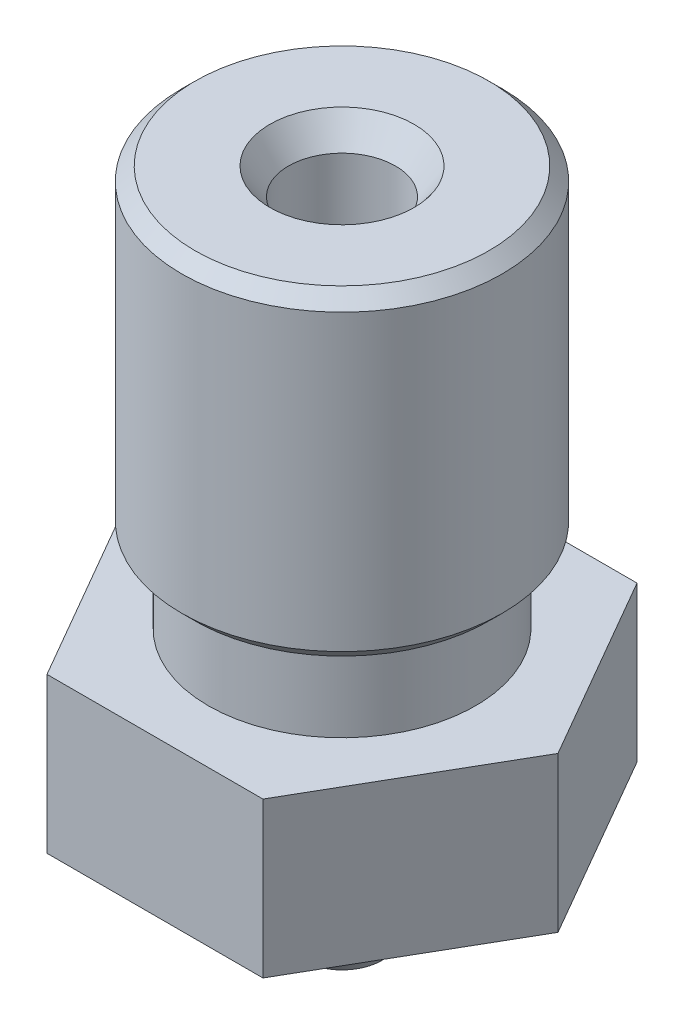
ISO-10303-21;
HEADER;
FILE_DESCRIPTION(('STEP AP214'),'2;1');
FILE_NAME('part.step','',(''),(''),'','','');
FILE_SCHEMA(('AUTOMOTIVE_DESIGN { 1 0 10303 214 1 1 1 1 }'));
ENDSEC;
DATA;
#1=APPLICATION_CONTEXT('core data for automotive mechanical design processes');
#2=APPLICATION_PROTOCOL_DEFINITION('international standard','automotive_design',2000,#1);
#3=PRODUCT_CONTEXT('',#1,'mechanical');
#4=PRODUCT('Part','Part','',(#3));
#5=PRODUCT_RELATED_PRODUCT_CATEGORY('part','',(#4));
#6=PRODUCT_DEFINITION_FORMATION('','',#4);
#7=PRODUCT_DEFINITION_CONTEXT('part definition',#1,'design');
#8=PRODUCT_DEFINITION('design','',#6,#7);
#9=PRODUCT_DEFINITION_SHAPE('','',#8);
#10=(LENGTH_UNIT() NAMED_UNIT(*) SI_UNIT(.MILLI.,.METRE.));
#11=(NAMED_UNIT(*) PLANE_ANGLE_UNIT() SI_UNIT($,.RADIAN.));
#12=(NAMED_UNIT(*) SI_UNIT($,.STERADIAN.) SOLID_ANGLE_UNIT());
#13=UNCERTAINTY_MEASURE_WITH_UNIT(LENGTH_MEASURE(1.E-05),#10,'distance_accuracy_value','');
#14=(GEOMETRIC_REPRESENTATION_CONTEXT(3) GLOBAL_UNCERTAINTY_ASSIGNED_CONTEXT((#13)) GLOBAL_UNIT_ASSIGNED_CONTEXT((#10,
#11,#12)) REPRESENTATION_CONTEXT('',''));
#15=CARTESIAN_POINT('',(0.,0.,0.));
#16=DIRECTION('',(0.,0.,1.));
#17=DIRECTION('',(1.,0.,0.));
#18=AXIS2_PLACEMENT_3D('',#15,#16,#17);
#19=CARTESIAN_POINT('',(0.75,-6.25,0.));
#20=DIRECTION('',(0.,-1.,0.));
#21=DIRECTION('',(0.,0.,-1.));
#22=AXIS2_PLACEMENT_3D('',#19,#20,#21);
#23=PLANE('',#22);
#24=CARTESIAN_POINT('',(0.,-6.25,0.));
#25=DIRECTION('',(0.,-1.,0.));
#26=DIRECTION('',(0.,0.,-1.));
#27=AXIS2_PLACEMENT_3D('',#24,#25,#26);
#28=CIRCLE('',#27,0.75);
#29=CARTESIAN_POINT('',(0.,-6.25,-0.75));
#30=VERTEX_POINT('',#29);
#31=EDGE_CURVE('E123',#30,#30,#28,.T.);
#32=ORIENTED_EDGE('',*,*,#31,.T.);
#33=EDGE_LOOP('',(#32));
#34=FACE_BOUND('',#33,.T.);
#35=CARTESIAN_POINT('',(0.,-6.25,0.));
#36=DIRECTION('',(0.,-1.,0.));
#37=DIRECTION('',(0.,0.,-1.));
#38=AXIS2_PLACEMENT_3D('',#35,#36,#37);
#39=CIRCLE('',#38,0.3);
#40=CARTESIAN_POINT('',(0.,-6.25,-0.3));
#41=VERTEX_POINT('',#40);
#42=EDGE_CURVE('E154',#41,#41,#39,.T.);
#43=ORIENTED_EDGE('',*,*,#42,.F.);
#44=EDGE_LOOP('',(#43));
#45=FACE_BOUND('',#44,.T.);
#46=ADVANCED_FACE('F32',(#34,#45),#23,.T.);
#47=CARTESIAN_POINT('',(0.,-6.25,0.));
#48=DIRECTION('',(0.,-1.,0.));
#49=DIRECTION('',(0.,0.,-1.));
#50=AXIS2_PLACEMENT_3D('',#47,#48,#49);
#51=CYLINDRICAL_SURFACE('',#50,0.3);
#52=ORIENTED_EDGE('',*,*,#42,.T.);
#53=EDGE_LOOP('',(#52));
#54=FACE_BOUND('',#53,.T.);
#55=CARTESIAN_POINT('',(0.,-5.05,0.));
#56=DIRECTION('',(0.,-1.,0.));
#57=DIRECTION('',(0.,0.,-1.));
#58=AXIS2_PLACEMENT_3D('',#55,#56,#57);
#59=CIRCLE('',#58,0.3);
#60=CARTESIAN_POINT('',(0.,-5.05,-0.3));
#61=VERTEX_POINT('',#60);
#62=EDGE_CURVE('E151',#61,#61,#59,.T.);
#63=ORIENTED_EDGE('',*,*,#62,.F.);
#64=EDGE_LOOP('',(#63));
#65=FACE_BOUND('',#64,.T.);
#66=ADVANCED_FACE('F196',(#54,#65),#51,.F.);
#67=CARTESIAN_POINT('',(0.,-4.74056606371057,0.));
#68=DIRECTION('',(0.,1.,0.));
#69=DIRECTION('',(0.,0.,1.));
#70=AXIS2_PLACEMENT_3D('',#67,#68,#69);
#71=CONICAL_SURFACE('',#70,0.995,1.15191730631626);
#72=ORIENTED_EDGE('',*,*,#62,.T.);
#73=EDGE_LOOP('',(#72));
#74=FACE_BOUND('',#73,.T.);
#75=CARTESIAN_POINT('',(0.,-4.74056606371057,0.));
#76=DIRECTION('',(0.,-1.,0.));
#77=DIRECTION('',(0.,0.,-1.));
#78=AXIS2_PLACEMENT_3D('',#75,#76,#77);
#79=CIRCLE('',#78,0.995);
#80=CARTESIAN_POINT('',(0.,-4.74056606371057,-0.995));
#81=VERTEX_POINT('',#80);
#82=EDGE_CURVE('E148',#81,#81,#79,.T.);
#83=ORIENTED_EDGE('',*,*,#82,.F.);
#84=EDGE_LOOP('',(#83));
#85=FACE_BOUND('',#84,.T.);
#86=ADVANCED_FACE('F202',(#74,#85),#71,.F.);
#87=CARTESIAN_POINT('',(0.,-6.25,0.));
#88=DIRECTION('',(0.,-1.,0.));
#89=DIRECTION('',(0.,0.,-1.));
#90=AXIS2_PLACEMENT_3D('',#87,#88,#89);
#91=CYLINDRICAL_SURFACE('',#90,0.995);
#92=ORIENTED_EDGE('',*,*,#82,.T.);
#93=EDGE_LOOP('',(#92));
#94=FACE_BOUND('',#93,.T.);
#95=CARTESIAN_POINT('',(0.,-4.1522261434488,0.));
#96=DIRECTION('',(0.,-1.,0.));
#97=DIRECTION('',(0.,0.,-1.));
#98=AXIS2_PLACEMENT_3D('',#95,#96,#97);
#99=CIRCLE('',#98,0.995);
#100=CARTESIAN_POINT('',(0.,-4.1522261434488,-0.995));
#101=VERTEX_POINT('',#100);
#102=EDGE_CURVE('E145',#101,#101,#99,.T.);
#103=ORIENTED_EDGE('',*,*,#102,.F.);
#104=EDGE_LOOP('',(#103));
#105=FACE_BOUND('',#104,.T.);
#106=ADVANCED_FACE('F209',(#94,#105),#91,.F.);
#107=CARTESIAN_POINT('',(0.,-4.15,0.));
#108=DIRECTION('',(0.,1.,0.));
#109=DIRECTION('',(0.,0.,1.));
#110=AXIS2_PLACEMENT_3D('',#107,#108,#109);
#111=CONICAL_SURFACE('',#110,1.00000000005,1.15191730631624);
#112=ORIENTED_EDGE('',*,*,#102,.T.);
#113=EDGE_LOOP('',(#112));
#114=FACE_BOUND('',#113,.T.);
#115=CARTESIAN_POINT('',(0.,-4.15,0.));
#116=DIRECTION('',(0.,-1.,0.));
#117=DIRECTION('',(0.,0.,-1.));
#118=AXIS2_PLACEMENT_3D('',#115,#116,#117);
#119=CIRCLE('',#118,1.00000000005);
#120=CARTESIAN_POINT('',(0.,-4.15,-1.00000000005));
#121=VERTEX_POINT('',#120);
#122=EDGE_CURVE('E142',#121,#121,#119,.T.);
#123=ORIENTED_EDGE('',*,*,#122,.F.);
#124=EDGE_LOOP('',(#123));
#125=FACE_BOUND('',#124,.T.);
#126=ADVANCED_FACE('F213',(#114,#125),#111,.F.);
#127=CARTESIAN_POINT('',(0.,-6.25,0.));
#128=DIRECTION('',(0.,-1.,0.));
#129=DIRECTION('',(0.,0.,-1.));
#130=AXIS2_PLACEMENT_3D('',#127,#128,#129);
#131=CYLINDRICAL_SURFACE('',#130,1.00000000005);
#132=ORIENTED_EDGE('',*,*,#122,.T.);
#133=EDGE_LOOP('',(#132));
#134=FACE_BOUND('',#133,.T.);
#135=CARTESIAN_POINT('',(0.,5.75,0.));
#136=DIRECTION('',(0.,-1.,0.));
#137=DIRECTION('',(0.,0.,-1.));
#138=AXIS2_PLACEMENT_3D('',#135,#136,#137);
#139=CIRCLE('',#138,1.00000000005);
#140=CARTESIAN_POINT('',(0.,5.75,-1.00000000005));
#141=VERTEX_POINT('',#140);
#142=EDGE_CURVE('E139',#141,#141,#139,.T.);
#143=ORIENTED_EDGE('',*,*,#142,.F.);
#144=EDGE_LOOP('',(#143));
#145=FACE_BOUND('',#144,.T.);
#146=ADVANCED_FACE('F217',(#134,#145),#131,.F.);
#147=CARTESIAN_POINT('',(0.,6.25,0.));
#148=DIRECTION('',(0.,1.,0.));
#149=DIRECTION('',(0.,0.,1.));
#150=AXIS2_PLACEMENT_3D('',#147,#148,#149);
#151=CONICAL_SURFACE('',#150,1.35010376915485,0.610865238198013);
#152=ORIENTED_EDGE('',*,*,#142,.T.);
#153=EDGE_LOOP('',(#152));
#154=FACE_BOUND('',#153,.T.);
#155=CARTESIAN_POINT('',(0.,6.25,0.));
#156=DIRECTION('',(0.,-1.,0.));
#157=DIRECTION('',(0.,0.,-1.));
#158=AXIS2_PLACEMENT_3D('',#155,#156,#157);
#159=CIRCLE('',#158,1.35010376915485);
#160=CARTESIAN_POINT('',(0.,6.25,-1.35010376915485));
#161=VERTEX_POINT('',#160);
#162=EDGE_CURVE('E136',#161,#161,#159,.T.);
#163=ORIENTED_EDGE('',*,*,#162,.F.);
#164=EDGE_LOOP('',(#163));
#165=FACE_BOUND('',#164,.T.);
#166=ADVANCED_FACE('F221',(#154,#165),#151,.F.);
#167=CARTESIAN_POINT('',(1.35010376915485,6.25,0.));
#168=DIRECTION('',(0.,1.,0.));
#169=DIRECTION('',(0.,0.,1.));
#170=AXIS2_PLACEMENT_3D('',#167,#168,#169);
#171=PLANE('',#170);
#172=CARTESIAN_POINT('',(0.,6.25,0.));
#173=DIRECTION('',(0.,1.,0.));
#174=DIRECTION('',(0.,0.,1.));
#175=AXIS2_PLACEMENT_3D('',#172,#173,#174);
#176=CIRCLE('',#175,2.75);
#177=CARTESIAN_POINT('',(0.,6.25,2.75));
#178=VERTEX_POINT('',#177);
#179=EDGE_CURVE('E11',#178,#178,#176,.T.);
#180=ORIENTED_EDGE('',*,*,#179,.T.);
#181=EDGE_LOOP('',(#180));
#182=FACE_BOUND('',#181,.T.);
#183=ORIENTED_EDGE('',*,*,#162,.T.);
#184=EDGE_LOOP('',(#183));
#185=FACE_BOUND('',#184,.T.);
#186=ADVANCED_FACE('F225',(#182,#185),#171,.T.);
#187=CARTESIAN_POINT('',(0.,-6.25,0.));
#188=DIRECTION('',(0.,-1.,0.));
#189=DIRECTION('',(0.,0.,-1.));
#190=AXIS2_PLACEMENT_3D('',#187,#188,#189);
#191=CYLINDRICAL_SURFACE('',#190,3.);
#192=CARTESIAN_POINT('',(0.,0.5,0.));
#193=DIRECTION('',(0.,-1.,0.));
#194=DIRECTION('',(0.,0.,-1.));
#195=AXIS2_PLACEMENT_3D('',#192,#193,#194);
#196=CIRCLE('',#195,3.);
#197=CARTESIAN_POINT('',(0.,0.5,-3.));
#198=VERTEX_POINT('',#197);
#199=EDGE_CURVE('E40',#198,#198,#196,.F.);
#200=ORIENTED_EDGE('',*,*,#199,.T.);
#201=EDGE_LOOP('',(#200));
#202=FACE_BOUND('',#201,.T.);
#203=CARTESIAN_POINT('',(0.,6.,0.));
#204=DIRECTION('',(0.,1.,0.));
#205=DIRECTION('',(0.,0.,1.));
#206=AXIS2_PLACEMENT_3D('',#203,#204,#205);
#207=CIRCLE('',#206,3.);
#208=CARTESIAN_POINT('',(0.,6.,3.));
#209=VERTEX_POINT('',#208);
#210=EDGE_CURVE('E160',#209,#209,#207,.F.);
#211=ORIENTED_EDGE('',*,*,#210,.T.);
#212=EDGE_LOOP('',(#211));
#213=FACE_BOUND('',#212,.T.);
#214=ADVANCED_FACE('F165',(#202,#213),#191,.T.);
#215=CARTESIAN_POINT('',(2.5,0.25,0.));
#216=DIRECTION('',(0.,-1.,0.));
#217=DIRECTION('',(0.,0.,-1.));
#218=AXIS2_PLACEMENT_3D('',#215,#216,#217);
#219=PLANE('',#218);
#220=CARTESIAN_POINT('',(0.,0.25,0.));
#221=DIRECTION('',(0.,-1.,0.));
#222=DIRECTION('',(0.,0.,-1.));
#223=AXIS2_PLACEMENT_3D('',#220,#221,#222);
#224=CIRCLE('',#223,2.75);
#225=CARTESIAN_POINT('',(0.,0.25,-2.75));
#226=VERTEX_POINT('',#225);
#227=EDGE_CURVE('E157',#226,#226,#224,.T.);
#228=ORIENTED_EDGE('',*,*,#227,.T.);
#229=EDGE_LOOP('',(#228));
#230=FACE_BOUND('',#229,.T.);
#231=CARTESIAN_POINT('',(0.,0.25,0.));
#232=DIRECTION('',(0.,-1.,0.));
#233=DIRECTION('',(0.,0.,-1.));
#234=AXIS2_PLACEMENT_3D('',#231,#232,#233);
#235=CIRCLE('',#234,2.5);
#236=CARTESIAN_POINT('',(0.,0.25,-2.5));
#237=VERTEX_POINT('',#236);
#238=EDGE_CURVE('E133',#237,#237,#235,.T.);
#239=ORIENTED_EDGE('',*,*,#238,.F.);
#240=EDGE_LOOP('',(#239));
#241=FACE_BOUND('',#240,.T.);
#242=ADVANCED_FACE('F174',(#230,#241),#219,.T.);
#243=CARTESIAN_POINT('',(0.,-6.25,0.));
#244=DIRECTION('',(0.,-1.,0.));
#245=DIRECTION('',(0.,0.,-1.));
#246=AXIS2_PLACEMENT_3D('',#243,#244,#245);
#247=CYLINDRICAL_SURFACE('',#246,2.5);
#248=ORIENTED_EDGE('',*,*,#238,.T.);
#249=EDGE_LOOP('',(#248));
#250=FACE_BOUND('',#249,.T.);
#251=CARTESIAN_POINT('',(0.,-1.25,0.));
#252=DIRECTION('',(0.,-1.,0.));
#253=DIRECTION('',(0.,0.,-1.));
#254=AXIS2_PLACEMENT_3D('',#251,#252,#253);
#255=CIRCLE('',#254,2.5);
#256=CARTESIAN_POINT('',(0.,-1.25,-2.5));
#257=VERTEX_POINT('',#256);
#258=EDGE_CURVE('E130',#257,#257,#255,.T.);
#259=ORIENTED_EDGE('',*,*,#258,.F.);
#260=EDGE_LOOP('',(#259));
#261=FACE_BOUND('',#260,.T.);
#262=ADVANCED_FACE('F177',(#250,#261),#247,.T.);
#263=CARTESIAN_POINT('',(2.5,-1.25,0.));
#264=DIRECTION('',(0.,1.,0.));
#265=DIRECTION('',(0.,0.,1.));
#266=AXIS2_PLACEMENT_3D('',#263,#264,#265);
#267=PLANE('',#266);
#268=ORIENTED_EDGE('',*,*,#258,.T.);
#269=EDGE_LOOP('',(#268));
#270=FACE_BOUND('',#269,.T.);
#271=DIRECTION('',(-0.5,0.,0.866025403784439));
#272=VECTOR('',#271,1.);
#273=CARTESIAN_POINT('',(4.04145188432738,-1.25,0.));
#274=LINE('',#273,#272);
#275=CARTESIAN_POINT('',(4.04145188432738,-1.25,0.));
#276=VERTEX_POINT('',#275);
#277=CARTESIAN_POINT('',(2.02072594216369,-1.25,3.5));
#278=VERTEX_POINT('',#277);
#279=EDGE_CURVE('E47',#276,#278,#274,.T.);
#280=ORIENTED_EDGE('',*,*,#279,.F.);
#281=DIRECTION('',(0.5,0.,0.866025403784439));
#282=VECTOR('',#281,1.);
#283=CARTESIAN_POINT('',(2.02072594216369,-1.25,-3.5));
#284=LINE('',#283,#282);
#285=CARTESIAN_POINT('',(2.02072594216369,-1.25,-3.5));
#286=VERTEX_POINT('',#285);
#287=EDGE_CURVE('E103',#286,#276,#284,.T.);
#288=ORIENTED_EDGE('',*,*,#287,.F.);
#289=DIRECTION('',(1.,0.,0.));
#290=VECTOR('',#289,1.);
#291=CARTESIAN_POINT('',(-2.02072594216369,-1.25,-3.5));
#292=LINE('',#291,#290);
#293=CARTESIAN_POINT('',(-2.02072594216369,-1.25,-3.5));
#294=VERTEX_POINT('',#293);
#295=EDGE_CURVE('E101',#294,#286,#292,.T.);
#296=ORIENTED_EDGE('',*,*,#295,.F.);
#297=DIRECTION('',(0.5,0.,-0.866025403784439));
#298=VECTOR('',#297,1.);
#299=CARTESIAN_POINT('',(-4.04145188432738,-1.25,0.));
#300=LINE('',#299,#298);
#301=CARTESIAN_POINT('',(-4.04145188432738,-1.25,0.));
#302=VERTEX_POINT('',#301);
#303=EDGE_CURVE('E89',#302,#294,#300,.T.);
#304=ORIENTED_EDGE('',*,*,#303,.F.);
#305=DIRECTION('',(-0.5,0.,-0.866025403784439));
#306=VECTOR('',#305,1.);
#307=CARTESIAN_POINT('',(-2.02072594216369,-1.25,3.5));
#308=LINE('',#307,#306);
#309=CARTESIAN_POINT('',(-2.02072594216369,-1.25,3.5));
#310=VERTEX_POINT('',#309);
#311=EDGE_CURVE('E111',#310,#302,#308,.T.);
#312=ORIENTED_EDGE('',*,*,#311,.F.);
#313=DIRECTION('',(-1.,0.,0.));
#314=VECTOR('',#313,1.);
#315=CARTESIAN_POINT('',(2.02072594216369,-1.25,3.5));
#316=LINE('',#315,#314);
#317=EDGE_CURVE('E55',#278,#310,#316,.T.);
#318=ORIENTED_EDGE('',*,*,#317,.F.);
#319=EDGE_LOOP('',(#280,#288,#296,#304,#312,#318));
#320=FACE_BOUND('',#319,.T.);
#321=ADVANCED_FACE('F102',(#270,#320),#267,.T.);
#322=CARTESIAN_POINT('',(3.5,-4.15,0.));
#323=DIRECTION('',(0.,-1.,0.));
#324=DIRECTION('',(0.,0.,-1.));
#325=AXIS2_PLACEMENT_3D('',#322,#323,#324);
#326=PLANE('',#325);
#327=DIRECTION('',(-0.5,0.,-0.866025403784439));
#328=VECTOR('',#327,1.);
#329=CARTESIAN_POINT('',(-2.02072594216369,-4.15,3.5));
#330=LINE('',#329,#328);
#331=CARTESIAN_POINT('',(-2.02072594216369,-4.15,3.5));
#332=VERTEX_POINT('',#331);
#333=CARTESIAN_POINT('',(-4.04145188432738,-4.15,0.));
#334=VERTEX_POINT('',#333);
#335=EDGE_CURVE('E405',#332,#334,#330,.T.);
#336=ORIENTED_EDGE('',*,*,#335,.T.);
#337=DIRECTION('',(0.5,0.,-0.866025403784439));
#338=VECTOR('',#337,1.);
#339=CARTESIAN_POINT('',(-4.04145188432738,-4.15,0.));
#340=LINE('',#339,#338);
#341=CARTESIAN_POINT('',(-2.02072594216369,-4.15,-3.5));
#342=VERTEX_POINT('',#341);
#343=EDGE_CURVE('E407',#334,#342,#340,.T.);
#344=ORIENTED_EDGE('',*,*,#343,.T.);
#345=DIRECTION('',(1.,0.,0.));
#346=VECTOR('',#345,1.);
#347=CARTESIAN_POINT('',(-2.02072594216369,-4.15,-3.5));
#348=LINE('',#347,#346);
#349=CARTESIAN_POINT('',(2.02072594216369,-4.15,-3.5));
#350=VERTEX_POINT('',#349);
#351=EDGE_CURVE('E110',#342,#350,#348,.T.);
#352=ORIENTED_EDGE('',*,*,#351,.T.);
#353=DIRECTION('',(0.5,0.,0.866025403784439));
#354=VECTOR('',#353,1.);
#355=CARTESIAN_POINT('',(2.02072594216369,-4.15,-3.5));
#356=LINE('',#355,#354);
#357=CARTESIAN_POINT('',(4.04145188432738,-4.15,0.));
#358=VERTEX_POINT('',#357);
#359=EDGE_CURVE('E127',#350,#358,#356,.T.);
#360=ORIENTED_EDGE('',*,*,#359,.T.);
#361=DIRECTION('',(-0.5,0.,0.866025403784438));
#362=VECTOR('',#361,1.);
#363=CARTESIAN_POINT('',(4.04145188432738,-4.15,0.));
#364=LINE('',#363,#362);
#365=CARTESIAN_POINT('',(2.02072594216369,-4.15,3.5));
#366=VERTEX_POINT('',#365);
#367=EDGE_CURVE('E120',#358,#366,#364,.T.);
#368=ORIENTED_EDGE('',*,*,#367,.T.);
#369=DIRECTION('',(-1.,0.,0.));
#370=VECTOR('',#369,1.);
#371=CARTESIAN_POINT('',(2.02072594216369,-4.15,3.5));
#372=LINE('',#371,#370);
#373=EDGE_CURVE('E392',#366,#332,#372,.T.);
#374=ORIENTED_EDGE('',*,*,#373,.T.);
#375=EDGE_LOOP('',(#336,#344,#352,#360,#368,#374));
#376=FACE_BOUND('',#375,.T.);
#377=CARTESIAN_POINT('',(0.,-4.15,0.));
#378=DIRECTION('',(0.,-1.,0.));
#379=DIRECTION('',(0.,0.,-1.));
#380=AXIS2_PLACEMENT_3D('',#377,#378,#379);
#381=CIRCLE('',#380,2.22043583024038);
#382=CARTESIAN_POINT('',(0.,-4.15,-2.22043583024038));
#383=VERTEX_POINT('',#382);
#384=EDGE_CURVE('E126',#383,#383,#381,.T.);
#385=ORIENTED_EDGE('',*,*,#384,.F.);
#386=EDGE_LOOP('',(#385));
#387=FACE_BOUND('',#386,.T.);
#388=ADVANCED_FACE('F187',(#376,#387),#326,.T.);
#389=CARTESIAN_POINT('',(0.,-6.25,0.));
#390=DIRECTION('',(0.,1.,0.));
#391=DIRECTION('',(0.,0.,1.));
#392=AXIS2_PLACEMENT_3D('',#389,#390,#391);
#393=CONICAL_SURFACE('',#392,0.75,0.610865238198013);
#394=ORIENTED_EDGE('',*,*,#384,.T.);
#395=EDGE_LOOP('',(#394));
#396=FACE_BOUND('',#395,.T.);
#397=ORIENTED_EDGE('',*,*,#31,.F.);
#398=EDGE_LOOP('',(#397));
#399=FACE_BOUND('',#398,.T.);
#400=ADVANCED_FACE('F192',(#396,#399),#393,.T.);
#401=CARTESIAN_POINT('',(4.04145188432738,9.44267662156363,0.));
#402=DIRECTION('',(0.866025403784438,0.,0.5));
#403=DIRECTION('',(0.5,0.,-0.866025403784439));
#404=AXIS2_PLACEMENT_3D('',#401,#402,#403);
#405=PLANE('',#404);
#406=ORIENTED_EDGE('',*,*,#279,.T.);
#407=DIRECTION('',(0.,-1.,0.));
#408=VECTOR('',#407,1.);
#409=CARTESIAN_POINT('',(2.02072594216369,9.44267662156363,3.5));
#410=LINE('',#409,#408);
#411=EDGE_CURVE('E121',#278,#366,#410,.T.);
#412=ORIENTED_EDGE('',*,*,#411,.T.);
#413=ORIENTED_EDGE('',*,*,#367,.F.);
#414=DIRECTION('',(0.,-1.,0.));
#415=VECTOR('',#414,1.);
#416=CARTESIAN_POINT('',(4.04145188432738,9.44267662156363,0.));
#417=LINE('',#416,#415);
#418=EDGE_CURVE('E107',#276,#358,#417,.T.);
#419=ORIENTED_EDGE('',*,*,#418,.F.);
#420=EDGE_LOOP('',(#406,#412,#413,#419));
#421=FACE_BOUND('',#420,.T.);
#422=ADVANCED_FACE('F257',(#421),#405,.T.);
#423=CARTESIAN_POINT('',(2.02072594216369,9.44267662156363,-3.5));
#424=DIRECTION('',(0.866025403784439,0.,-0.5));
#425=DIRECTION('',(-0.5,0.,-0.866025403784439));
#426=AXIS2_PLACEMENT_3D('',#423,#424,#425);
#427=PLANE('',#426);
#428=ORIENTED_EDGE('',*,*,#287,.T.);
#429=ORIENTED_EDGE('',*,*,#418,.T.);
#430=ORIENTED_EDGE('',*,*,#359,.F.);
#431=DIRECTION('',(0.,-1.,0.));
#432=VECTOR('',#431,1.);
#433=CARTESIAN_POINT('',(2.02072594216369,9.44267662156363,-3.5));
#434=LINE('',#433,#432);
#435=EDGE_CURVE('E98',#286,#350,#434,.T.);
#436=ORIENTED_EDGE('',*,*,#435,.F.);
#437=EDGE_LOOP('',(#428,#429,#430,#436));
#438=FACE_BOUND('',#437,.T.);
#439=ADVANCED_FACE('F279',(#438),#427,.T.);
#440=CARTESIAN_POINT('',(-2.02072594216369,9.44267662156363,-3.5));
#441=DIRECTION('',(0.,0.,-1.));
#442=DIRECTION('',(-1.,0.,0.));
#443=AXIS2_PLACEMENT_3D('',#440,#441,#442);
#444=PLANE('',#443);
#445=ORIENTED_EDGE('',*,*,#295,.T.);
#446=ORIENTED_EDGE('',*,*,#435,.T.);
#447=ORIENTED_EDGE('',*,*,#351,.F.);
#448=DIRECTION('',(0.,-1.,0.));
#449=VECTOR('',#448,1.);
#450=CARTESIAN_POINT('',(-2.02072594216369,9.44267662156363,-3.5));
#451=LINE('',#450,#449);
#452=EDGE_CURVE('E93',#294,#342,#451,.T.);
#453=ORIENTED_EDGE('',*,*,#452,.F.);
#454=EDGE_LOOP('',(#445,#446,#447,#453));
#455=FACE_BOUND('',#454,.T.);
#456=ADVANCED_FACE('F109',(#455),#444,.T.);
#457=CARTESIAN_POINT('',(-4.04145188432738,9.44267662156363,0.));
#458=DIRECTION('',(-0.866025403784439,0.,-0.5));
#459=DIRECTION('',(-0.5,0.,0.866025403784439));
#460=AXIS2_PLACEMENT_3D('',#457,#458,#459);
#461=PLANE('',#460);
#462=ORIENTED_EDGE('',*,*,#303,.T.);
#463=ORIENTED_EDGE('',*,*,#452,.T.);
#464=ORIENTED_EDGE('',*,*,#343,.F.);
#465=DIRECTION('',(0.,-1.,0.));
#466=VECTOR('',#465,1.);
#467=CARTESIAN_POINT('',(-4.04145188432738,9.44267662156363,0.));
#468=LINE('',#467,#466);
#469=EDGE_CURVE('E96',#302,#334,#468,.T.);
#470=ORIENTED_EDGE('',*,*,#469,.F.);
#471=EDGE_LOOP('',(#462,#463,#464,#470));
#472=FACE_BOUND('',#471,.T.);
#473=ADVANCED_FACE('F91',(#472),#461,.T.);
#474=CARTESIAN_POINT('',(-2.02072594216369,9.44267662156363,3.5));
#475=DIRECTION('',(-0.866025403784439,0.,0.5));
#476=DIRECTION('',(0.5,0.,0.866025403784439));
#477=AXIS2_PLACEMENT_3D('',#474,#475,#476);
#478=PLANE('',#477);
#479=ORIENTED_EDGE('',*,*,#311,.T.);
#480=ORIENTED_EDGE('',*,*,#469,.T.);
#481=ORIENTED_EDGE('',*,*,#335,.F.);
#482=DIRECTION('',(0.,-1.,0.));
#483=VECTOR('',#482,1.);
#484=CARTESIAN_POINT('',(-2.02072594216369,9.44267662156363,3.5));
#485=LINE('',#484,#483);
#486=EDGE_CURVE('E118',#310,#332,#485,.T.);
#487=ORIENTED_EDGE('',*,*,#486,.F.);
#488=EDGE_LOOP('',(#479,#480,#481,#487));
#489=FACE_BOUND('',#488,.T.);
#490=ADVANCED_FACE('F305',(#489),#478,.T.);
#491=CARTESIAN_POINT('',(2.02072594216369,9.44267662156363,3.5));
#492=DIRECTION('',(0.,0.,1.));
#493=DIRECTION('',(1.,0.,0.));
#494=AXIS2_PLACEMENT_3D('',#491,#492,#493);
#495=PLANE('',#494);
#496=ORIENTED_EDGE('',*,*,#317,.T.);
#497=ORIENTED_EDGE('',*,*,#486,.T.);
#498=ORIENTED_EDGE('',*,*,#373,.F.);
#499=ORIENTED_EDGE('',*,*,#411,.F.);
#500=EDGE_LOOP('',(#496,#497,#498,#499));
#501=FACE_BOUND('',#500,.T.);
#502=ADVANCED_FACE('F171',(#501),#495,.T.);
#503=CARTESIAN_POINT('',(0.,0.25,0.));
#504=DIRECTION('',(0.,1.,0.));
#505=DIRECTION('',(0.,0.,1.));
#506=AXIS2_PLACEMENT_3D('',#503,#504,#505);
#507=CONICAL_SURFACE('',#506,2.75,0.785398163397444);
#508=ORIENTED_EDGE('',*,*,#199,.F.);
#509=EDGE_LOOP('',(#508));
#510=FACE_BOUND('',#509,.T.);
#511=ORIENTED_EDGE('',*,*,#227,.F.);
#512=EDGE_LOOP('',(#511));
#513=FACE_BOUND('',#512,.T.);
#514=ADVANCED_FACE('F168',(#510,#513),#507,.T.);
#515=CARTESIAN_POINT('',(0.,6.,0.));
#516=DIRECTION('',(0.,-1.,0.));
#517=DIRECTION('',(0.,0.,-1.));
#518=AXIS2_PLACEMENT_3D('',#515,#516,#517);
#519=CONICAL_SURFACE('',#518,3.,0.785398163397447);
#520=ORIENTED_EDGE('',*,*,#179,.F.);
#521=EDGE_LOOP('',(#520));
#522=FACE_BOUND('',#521,.T.);
#523=ORIENTED_EDGE('',*,*,#210,.F.);
#524=EDGE_LOOP('',(#523));
#525=FACE_BOUND('',#524,.T.);
#526=ADVANCED_FACE('F34',(#522,#525),#519,.T.);
#527=CLOSED_SHELL('',(#46,#66,#86,#106,#126,#146,#166,#186,#214,#242,#262,#321,#388,#400,#422,
#439,#456,#473,#490,#502,#514,#526));
#528=MANIFOLD_SOLID_BREP('B2',#527);
#529=ADVANCED_BREP_SHAPE_REPRESENTATION('',(#18,#528),#14);
#530=SHAPE_DEFINITION_REPRESENTATION(#9,#529);
ENDSEC;
END-ISO-10303-21;
